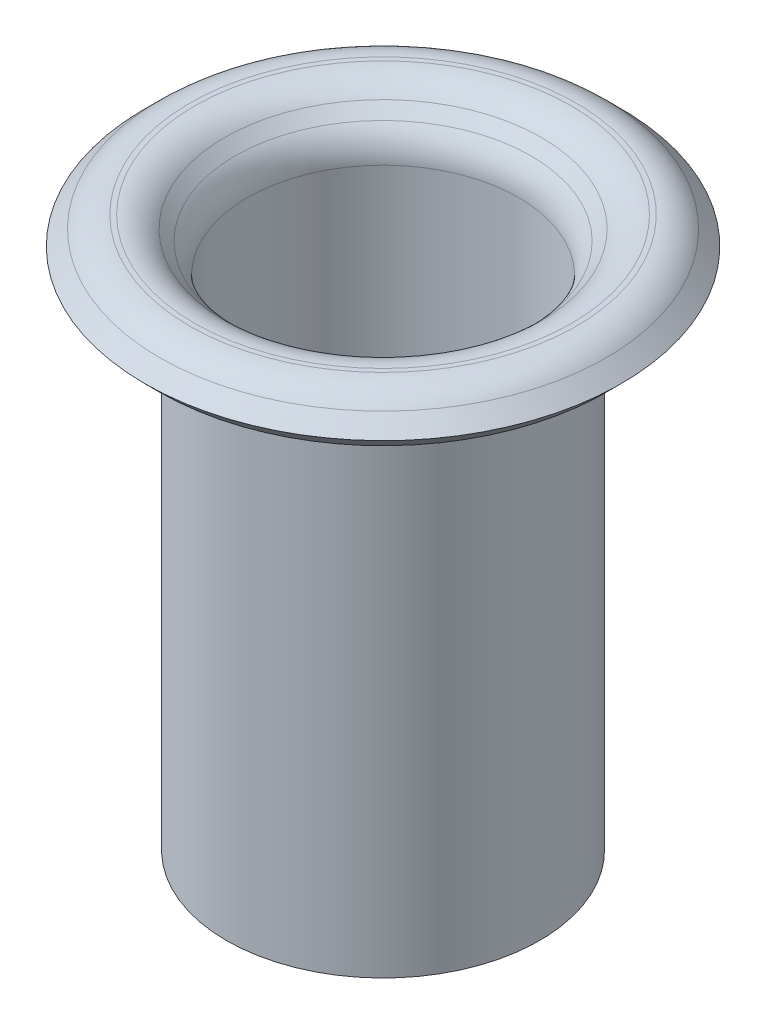
ISO-10303-21;
HEADER;
FILE_DESCRIPTION(('STEP AP214'),'2;1');
FILE_NAME('part.step','',(''),(''),'','','');
FILE_SCHEMA(('AUTOMOTIVE_DESIGN { 1 0 10303 214 1 1 1 1 }'));
ENDSEC;
DATA;
#1=APPLICATION_CONTEXT('core data for automotive mechanical design processes');
#2=APPLICATION_PROTOCOL_DEFINITION('international standard','automotive_design',2000,#1);
#3=PRODUCT_CONTEXT('',#1,'mechanical');
#4=PRODUCT('Part','Part','',(#3));
#5=PRODUCT_RELATED_PRODUCT_CATEGORY('part','',(#4));
#6=PRODUCT_DEFINITION_FORMATION('','',#4);
#7=PRODUCT_DEFINITION_CONTEXT('part definition',#1,'design');
#8=PRODUCT_DEFINITION('design','',#6,#7);
#9=PRODUCT_DEFINITION_SHAPE('','',#8);
#10=(LENGTH_UNIT() NAMED_UNIT(*) SI_UNIT(.MILLI.,.METRE.));
#11=(NAMED_UNIT(*) PLANE_ANGLE_UNIT() SI_UNIT($,.RADIAN.));
#12=(NAMED_UNIT(*) SI_UNIT($,.STERADIAN.) SOLID_ANGLE_UNIT());
#13=UNCERTAINTY_MEASURE_WITH_UNIT(LENGTH_MEASURE(1.E-05),#10,'distance_accuracy_value','');
#14=(GEOMETRIC_REPRESENTATION_CONTEXT(3) GLOBAL_UNCERTAINTY_ASSIGNED_CONTEXT((#13)) GLOBAL_UNIT_ASSIGNED_CONTEXT((#10,
#11,#12)) REPRESENTATION_CONTEXT('',''));
#15=CARTESIAN_POINT('',(0.,0.,0.));
#16=DIRECTION('',(0.,0.,1.));
#17=DIRECTION('',(1.,0.,0.));
#18=AXIS2_PLACEMENT_3D('',#15,#16,#17);
#19=CARTESIAN_POINT('',(-1.28,-5.2,0.));
#20=DIRECTION('',(0.,-1.,0.));
#21=DIRECTION('',(0.,0.,-1.));
#22=AXIS2_PLACEMENT_3D('',#19,#20,#21);
#23=PLANE('',#22);
#24=CARTESIAN_POINT('',(0.,-5.2,0.));
#25=DIRECTION('',(0.,1.,0.));
#26=DIRECTION('',(0.,0.,1.));
#27=AXIS2_PLACEMENT_3D('',#24,#25,#26);
#28=CIRCLE('',#27,1.28);
#29=CARTESIAN_POINT('',(0.,-5.2,1.28));
#30=VERTEX_POINT('',#29);
#31=EDGE_CURVE('E89',#30,#30,#28,.T.);
#32=ORIENTED_EDGE('',*,*,#31,.T.);
#33=EDGE_LOOP('',(#32));
#34=FACE_BOUND('',#33,.T.);
#35=CARTESIAN_POINT('',(0.,-5.2,0.));
#36=DIRECTION('',(0.,1.,0.));
#37=DIRECTION('',(0.,0.,1.));
#38=AXIS2_PLACEMENT_3D('',#35,#36,#37);
#39=CIRCLE('',#38,1.48);
#40=CARTESIAN_POINT('',(0.,-5.2,1.48));
#41=VERTEX_POINT('',#40);
#42=EDGE_CURVE('E10',#41,#41,#39,.T.);
#43=ORIENTED_EDGE('',*,*,#42,.F.);
#44=EDGE_LOOP('',(#43));
#45=FACE_BOUND('',#44,.T.);
#46=ADVANCED_FACE('F37',(#34,#45),#23,.T.);
#47=CARTESIAN_POINT('',(0.,0.,0.));
#48=DIRECTION('',(0.,1.,0.));
#49=DIRECTION('',(0.,0.,1.));
#50=AXIS2_PLACEMENT_3D('',#47,#48,#49);
#51=CYLINDRICAL_SURFACE('',#50,1.48);
#52=ORIENTED_EDGE('',*,*,#42,.T.);
#53=EDGE_LOOP('',(#52));
#54=FACE_BOUND('',#53,.T.);
#55=CARTESIAN_POINT('',(0.,-0.5,0.));
#56=DIRECTION('',(0.,1.,0.));
#57=DIRECTION('',(0.,0.,1.));
#58=AXIS2_PLACEMENT_3D('',#55,#56,#57);
#59=CIRCLE('',#58,1.48);
#60=CARTESIAN_POINT('',(0.,-0.5,1.48));
#61=VERTEX_POINT('',#60);
#62=EDGE_CURVE('E43',#61,#61,#59,.T.);
#63=ORIENTED_EDGE('',*,*,#62,.F.);
#64=EDGE_LOOP('',(#63));
#65=FACE_BOUND('',#64,.T.);
#66=ADVANCED_FACE('F107',(#54,#65),#51,.T.);
#67=CARTESIAN_POINT('',(0.,-0.5,0.));
#68=DIRECTION('',(0.,1.,0.));
#69=DIRECTION('',(0.,0.,1.));
#70=AXIS2_PLACEMENT_3D('',#67,#68,#69);
#71=TOROIDAL_SURFACE('',#70,1.68,0.2);
#72=ORIENTED_EDGE('',*,*,#62,.T.);
#73=EDGE_LOOP('',(#72));
#74=FACE_BOUND('',#73,.T.);
#75=CARTESIAN_POINT('',(0.,-0.35857864376269,0.));
#76=DIRECTION('',(0.,1.,0.));
#77=DIRECTION('',(0.,0.,1.));
#78=AXIS2_PLACEMENT_3D('',#75,#76,#77);
#79=CIRCLE('',#78,1.53857864376269);
#80=CARTESIAN_POINT('',(0.,-0.35857864376269,1.53857864376269));
#81=VERTEX_POINT('',#80);
#82=EDGE_CURVE('E47',#81,#81,#79,.T.);
#83=ORIENTED_EDGE('',*,*,#82,.F.);
#84=EDGE_LOOP('',(#83));
#85=FACE_BOUND('',#84,.T.);
#86=ADVANCED_FACE('F111',(#74,#85),#71,.F.);
#87=CARTESIAN_POINT('',(0.,-0.25857864376269,0.));
#88=DIRECTION('',(0.,1.,0.));
#89=DIRECTION('',(0.,0.,1.));
#90=AXIS2_PLACEMENT_3D('',#87,#88,#89);
#91=CONICAL_SURFACE('',#90,1.63857864376269,0.78539816339745);
#92=ORIENTED_EDGE('',*,*,#82,.T.);
#93=EDGE_LOOP('',(#92));
#94=FACE_BOUND('',#93,.T.);
#95=CARTESIAN_POINT('',(0.,-0.25857864376269,0.));
#96=DIRECTION('',(0.,1.,0.));
#97=DIRECTION('',(0.,0.,1.));
#98=AXIS2_PLACEMENT_3D('',#95,#96,#97);
#99=CIRCLE('',#98,1.63857864376269);
#100=CARTESIAN_POINT('',(0.,-0.25857864376269,1.63857864376269));
#101=VERTEX_POINT('',#100);
#102=EDGE_CURVE('E51',#101,#101,#99,.T.);
#103=ORIENTED_EDGE('',*,*,#102,.F.);
#104=EDGE_LOOP('',(#103));
#105=FACE_BOUND('',#104,.T.);
#106=ADVANCED_FACE('F115',(#94,#105),#91,.T.);
#107=CARTESIAN_POINT('',(0.,-0.4,0.));
#108=DIRECTION('',(0.,1.,0.));
#109=DIRECTION('',(0.,0.,1.));
#110=AXIS2_PLACEMENT_3D('',#107,#108,#109);
#111=TOROIDAL_SURFACE('',#110,1.78,0.2);
#112=ORIENTED_EDGE('',*,*,#102,.T.);
#113=EDGE_LOOP('',(#112));
#114=FACE_BOUND('',#113,.T.);
#115=CARTESIAN_POINT('',(0.,-0.2,0.));
#116=DIRECTION('',(0.,1.,0.));
#117=DIRECTION('',(0.,0.,1.));
#118=AXIS2_PLACEMENT_3D('',#115,#116,#117);
#119=CIRCLE('',#118,1.78);
#120=CARTESIAN_POINT('',(0.,-0.2,1.78));
#121=VERTEX_POINT('',#120);
#122=EDGE_CURVE('E56',#121,#121,#119,.T.);
#123=ORIENTED_EDGE('',*,*,#122,.F.);
#124=EDGE_LOOP('',(#123));
#125=FACE_BOUND('',#124,.T.);
#126=ADVANCED_FACE('F121',(#114,#125),#111,.F.);
#127=CARTESIAN_POINT('',(-1.82573593128807,-0.2,0.));
#128=DIRECTION('',(0.,-1.,0.));
#129=DIRECTION('',(0.,0.,-1.));
#130=AXIS2_PLACEMENT_3D('',#127,#128,#129);
#131=PLANE('',#130);
#132=ORIENTED_EDGE('',*,*,#122,.T.);
#133=EDGE_LOOP('',(#132));
#134=FACE_BOUND('',#133,.T.);
#135=CARTESIAN_POINT('',(0.,-0.2,0.));
#136=DIRECTION('',(0.,1.,0.));
#137=DIRECTION('',(0.,0.,1.));
#138=AXIS2_PLACEMENT_3D('',#135,#136,#137);
#139=CIRCLE('',#138,1.82573593128807);
#140=CARTESIAN_POINT('',(0.,-0.2,1.82573593128807));
#141=VERTEX_POINT('',#140);
#142=EDGE_CURVE('E59',#141,#141,#139,.T.);
#143=ORIENTED_EDGE('',*,*,#142,.F.);
#144=EDGE_LOOP('',(#143));
#145=FACE_BOUND('',#144,.T.);
#146=ADVANCED_FACE('F125',(#134,#145),#131,.T.);
#147=CARTESIAN_POINT('',(0.,-0.4,0.));
#148=DIRECTION('',(0.,1.,0.));
#149=DIRECTION('',(0.,0.,1.));
#150=AXIS2_PLACEMENT_3D('',#147,#148,#149);
#151=TOROIDAL_SURFACE('',#150,1.82573593128807,0.2);
#152=ORIENTED_EDGE('',*,*,#142,.T.);
#153=EDGE_LOOP('',(#152));
#154=FACE_BOUND('',#153,.T.);
#155=CARTESIAN_POINT('',(0.,-0.258578643762691,0.));
#156=DIRECTION('',(0.,1.,0.));
#157=DIRECTION('',(0.,0.,1.));
#158=AXIS2_PLACEMENT_3D('',#155,#156,#157);
#159=CIRCLE('',#158,1.96715728752538);
#160=CARTESIAN_POINT('',(0.,-0.258578643762691,1.96715728752538));
#161=VERTEX_POINT('',#160);
#162=EDGE_CURVE('E62',#161,#161,#159,.T.);
#163=ORIENTED_EDGE('',*,*,#162,.F.);
#164=EDGE_LOOP('',(#163));
#165=FACE_BOUND('',#164,.T.);
#166=ADVANCED_FACE('F129',(#154,#165),#151,.F.);
#167=CARTESIAN_POINT('',(0.,-0.4,0.));
#168=DIRECTION('',(0.,-1.,0.));
#169=DIRECTION('',(0.,0.,-1.));
#170=AXIS2_PLACEMENT_3D('',#167,#168,#169);
#171=CONICAL_SURFACE('',#170,2.10857864376269,0.785398163397447);
#172=ORIENTED_EDGE('',*,*,#162,.T.);
#173=EDGE_LOOP('',(#172));
#174=FACE_BOUND('',#173,.T.);
#175=CARTESIAN_POINT('',(0.,-0.4,0.));
#176=DIRECTION('',(0.,1.,0.));
#177=DIRECTION('',(0.,0.,1.));
#178=AXIS2_PLACEMENT_3D('',#175,#176,#177);
#179=CIRCLE('',#178,2.10857864376269);
#180=CARTESIAN_POINT('',(0.,-0.4,2.10857864376269));
#181=VERTEX_POINT('',#180);
#182=EDGE_CURVE('E65',#181,#181,#179,.T.);
#183=ORIENTED_EDGE('',*,*,#182,.F.);
#184=EDGE_LOOP('',(#183));
#185=FACE_BOUND('',#184,.T.);
#186=ADVANCED_FACE('F133',(#174,#185),#171,.F.);
#187=CARTESIAN_POINT('',(0.,-0.258578643762691,0.));
#188=DIRECTION('',(0.,1.,0.));
#189=DIRECTION('',(0.,0.,1.));
#190=AXIS2_PLACEMENT_3D('',#187,#188,#189);
#191=CONICAL_SURFACE('',#190,2.25,0.78539816339745);
#192=ORIENTED_EDGE('',*,*,#182,.T.);
#193=EDGE_LOOP('',(#192));
#194=FACE_BOUND('',#193,.T.);
#195=CARTESIAN_POINT('',(0.,-0.258578643762691,0.));
#196=DIRECTION('',(0.,1.,0.));
#197=DIRECTION('',(0.,0.,1.));
#198=AXIS2_PLACEMENT_3D('',#195,#196,#197);
#199=CIRCLE('',#198,2.25);
#200=CARTESIAN_POINT('',(0.,-0.258578643762691,2.25));
#201=VERTEX_POINT('',#200);
#202=EDGE_CURVE('E68',#201,#201,#199,.T.);
#203=ORIENTED_EDGE('',*,*,#202,.F.);
#204=EDGE_LOOP('',(#203));
#205=FACE_BOUND('',#204,.T.);
#206=ADVANCED_FACE('F137',(#194,#205),#191,.T.);
#207=CARTESIAN_POINT('',(0.,-0.117157287525382,0.));
#208=DIRECTION('',(0.,-1.,0.));
#209=DIRECTION('',(0.,0.,-1.));
#210=AXIS2_PLACEMENT_3D('',#207,#208,#209);
#211=CONICAL_SURFACE('',#210,2.10857864376269,0.78539816339745);
#212=ORIENTED_EDGE('',*,*,#202,.T.);
#213=EDGE_LOOP('',(#212));
#214=FACE_BOUND('',#213,.T.);
#215=CARTESIAN_POINT('',(0.,-0.117157287525382,0.));
#216=DIRECTION('',(0.,1.,0.));
#217=DIRECTION('',(0.,0.,1.));
#218=AXIS2_PLACEMENT_3D('',#215,#216,#217);
#219=CIRCLE('',#218,2.10857864376269);
#220=CARTESIAN_POINT('',(0.,-0.117157287525382,2.10857864376269));
#221=VERTEX_POINT('',#220);
#222=EDGE_CURVE('E71',#221,#221,#219,.T.);
#223=ORIENTED_EDGE('',*,*,#222,.F.);
#224=EDGE_LOOP('',(#223));
#225=FACE_BOUND('',#224,.T.);
#226=ADVANCED_FACE('F141',(#214,#225),#211,.T.);
#227=CARTESIAN_POINT('',(0.,-0.4,0.));
#228=DIRECTION('',(0.,1.,0.));
#229=DIRECTION('',(0.,0.,1.));
#230=AXIS2_PLACEMENT_3D('',#227,#228,#229);
#231=TOROIDAL_SURFACE('',#230,1.82573593128807,0.4);
#232=ORIENTED_EDGE('',*,*,#222,.T.);
#233=EDGE_LOOP('',(#232));
#234=FACE_BOUND('',#233,.T.);
#235=CARTESIAN_POINT('',(0.,0.,0.));
#236=DIRECTION('',(0.,1.,0.));
#237=DIRECTION('',(0.,0.,1.));
#238=AXIS2_PLACEMENT_3D('',#235,#236,#237);
#239=CIRCLE('',#238,1.82573593128807);
#240=CARTESIAN_POINT('',(0.,0.,1.82573593128807));
#241=VERTEX_POINT('',#240);
#242=EDGE_CURVE('E74',#241,#241,#239,.T.);
#243=ORIENTED_EDGE('',*,*,#242,.F.);
#244=EDGE_LOOP('',(#243));
#245=FACE_BOUND('',#244,.T.);
#246=ADVANCED_FACE('F145',(#234,#245),#231,.T.);
#247=CARTESIAN_POINT('',(-1.82573593128807,0.,0.));
#248=DIRECTION('',(0.,1.,0.));
#249=DIRECTION('',(0.,0.,1.));
#250=AXIS2_PLACEMENT_3D('',#247,#248,#249);
#251=PLANE('',#250);
#252=ORIENTED_EDGE('',*,*,#242,.T.);
#253=EDGE_LOOP('',(#252));
#254=FACE_BOUND('',#253,.T.);
#255=CARTESIAN_POINT('',(0.,0.,0.));
#256=DIRECTION('',(0.,1.,0.));
#257=DIRECTION('',(0.,0.,1.));
#258=AXIS2_PLACEMENT_3D('',#255,#256,#257);
#259=CIRCLE('',#258,1.78);
#260=CARTESIAN_POINT('',(0.,0.,1.78));
#261=VERTEX_POINT('',#260);
#262=EDGE_CURVE('E77',#261,#261,#259,.T.);
#263=ORIENTED_EDGE('',*,*,#262,.F.);
#264=EDGE_LOOP('',(#263));
#265=FACE_BOUND('',#264,.T.);
#266=ADVANCED_FACE('F149',(#254,#265),#251,.T.);
#267=CARTESIAN_POINT('',(0.,-0.4,0.));
#268=DIRECTION('',(0.,1.,0.));
#269=DIRECTION('',(0.,0.,1.));
#270=AXIS2_PLACEMENT_3D('',#267,#268,#269);
#271=TOROIDAL_SURFACE('',#270,1.78,0.4);
#272=ORIENTED_EDGE('',*,*,#262,.T.);
#273=EDGE_LOOP('',(#272));
#274=FACE_BOUND('',#273,.T.);
#275=CARTESIAN_POINT('',(0.,-0.117157287525381,0.));
#276=DIRECTION('',(0.,1.,0.));
#277=DIRECTION('',(0.,0.,1.));
#278=AXIS2_PLACEMENT_3D('',#275,#276,#277);
#279=CIRCLE('',#278,1.49715728752538);
#280=CARTESIAN_POINT('',(0.,-0.117157287525381,1.49715728752538));
#281=VERTEX_POINT('',#280);
#282=EDGE_CURVE('E80',#281,#281,#279,.T.);
#283=ORIENTED_EDGE('',*,*,#282,.F.);
#284=EDGE_LOOP('',(#283));
#285=FACE_BOUND('',#284,.T.);
#286=ADVANCED_FACE('F153',(#274,#285),#271,.T.);
#287=CARTESIAN_POINT('',(0.,-0.217157287525381,0.));
#288=DIRECTION('',(0.,1.,0.));
#289=DIRECTION('',(0.,0.,1.));
#290=AXIS2_PLACEMENT_3D('',#287,#288,#289);
#291=CONICAL_SURFACE('',#290,1.39715728752538,0.78539816339745);
#292=ORIENTED_EDGE('',*,*,#282,.T.);
#293=EDGE_LOOP('',(#292));
#294=FACE_BOUND('',#293,.T.);
#295=CARTESIAN_POINT('',(0.,-0.217157287525381,0.));
#296=DIRECTION('',(0.,1.,0.));
#297=DIRECTION('',(0.,0.,1.));
#298=AXIS2_PLACEMENT_3D('',#295,#296,#297);
#299=CIRCLE('',#298,1.39715728752538);
#300=CARTESIAN_POINT('',(0.,-0.217157287525381,1.39715728752538));
#301=VERTEX_POINT('',#300);
#302=EDGE_CURVE('E83',#301,#301,#299,.T.);
#303=ORIENTED_EDGE('',*,*,#302,.F.);
#304=EDGE_LOOP('',(#303));
#305=FACE_BOUND('',#304,.T.);
#306=ADVANCED_FACE('F103',(#294,#305),#291,.F.);
#307=CARTESIAN_POINT('',(0.,-0.5,0.));
#308=DIRECTION('',(0.,1.,0.));
#309=DIRECTION('',(0.,0.,1.));
#310=AXIS2_PLACEMENT_3D('',#307,#308,#309);
#311=TOROIDAL_SURFACE('',#310,1.68,0.4);
#312=ORIENTED_EDGE('',*,*,#302,.T.);
#313=EDGE_LOOP('',(#312));
#314=FACE_BOUND('',#313,.T.);
#315=CARTESIAN_POINT('',(0.,-0.5,0.));
#316=DIRECTION('',(0.,1.,0.));
#317=DIRECTION('',(0.,0.,1.));
#318=AXIS2_PLACEMENT_3D('',#315,#316,#317);
#319=CIRCLE('',#318,1.28);
#320=CARTESIAN_POINT('',(0.,-0.5,1.28));
#321=VERTEX_POINT('',#320);
#322=EDGE_CURVE('E86',#321,#321,#319,.T.);
#323=ORIENTED_EDGE('',*,*,#322,.F.);
#324=EDGE_LOOP('',(#323));
#325=FACE_BOUND('',#324,.T.);
#326=ADVANCED_FACE('F97',(#314,#325),#311,.T.);
#327=CARTESIAN_POINT('',(0.,0.,0.));
#328=DIRECTION('',(0.,1.,0.));
#329=DIRECTION('',(0.,0.,1.));
#330=AXIS2_PLACEMENT_3D('',#327,#328,#329);
#331=CYLINDRICAL_SURFACE('',#330,1.28);
#332=ORIENTED_EDGE('',*,*,#322,.T.);
#333=EDGE_LOOP('',(#332));
#334=FACE_BOUND('',#333,.T.);
#335=ORIENTED_EDGE('',*,*,#31,.F.);
#336=EDGE_LOOP('',(#335));
#337=FACE_BOUND('',#336,.T.);
#338=ADVANCED_FACE('F95',(#334,#337),#331,.F.);
#339=CLOSED_SHELL('',(#46,#66,#86,#106,#126,#146,#166,#186,#206,#226,#246,#266,#286,#306,#326,#338));
#340=MANIFOLD_SOLID_BREP('B2',#339);
#341=ADVANCED_BREP_SHAPE_REPRESENTATION('',(#18,#340),#14);
#342=SHAPE_DEFINITION_REPRESENTATION(#9,#341);
ENDSEC;
END-ISO-10303-21;
